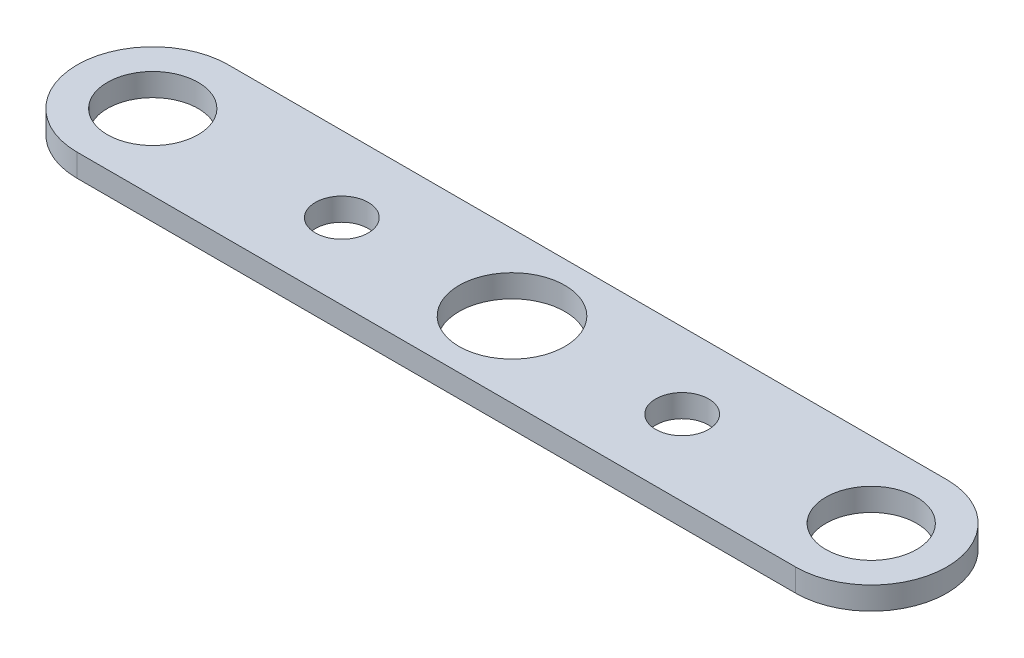
ISO-10303-21;
HEADER;
FILE_DESCRIPTION(('STEP AP214'),'2;1');
FILE_NAME('part.step','',(''),(''),'','','');
FILE_SCHEMA(('AUTOMOTIVE_DESIGN { 1 0 10303 214 1 1 1 1 }'));
ENDSEC;
DATA;
#1=APPLICATION_CONTEXT('core data for automotive mechanical design processes');
#2=APPLICATION_PROTOCOL_DEFINITION('international standard','automotive_design',2000,#1);
#3=PRODUCT_CONTEXT('',#1,'mechanical');
#4=PRODUCT('Part','Part','',(#3));
#5=PRODUCT_RELATED_PRODUCT_CATEGORY('part','',(#4));
#6=PRODUCT_DEFINITION_FORMATION('','',#4);
#7=PRODUCT_DEFINITION_CONTEXT('part definition',#1,'design');
#8=PRODUCT_DEFINITION('design','',#6,#7);
#9=PRODUCT_DEFINITION_SHAPE('','',#8);
#10=(LENGTH_UNIT() NAMED_UNIT(*) SI_UNIT(.MILLI.,.METRE.));
#11=(NAMED_UNIT(*) PLANE_ANGLE_UNIT() SI_UNIT($,.RADIAN.));
#12=(NAMED_UNIT(*) SI_UNIT($,.STERADIAN.) SOLID_ANGLE_UNIT());
#13=UNCERTAINTY_MEASURE_WITH_UNIT(LENGTH_MEASURE(1.E-05),#10,'distance_accuracy_value','');
#14=(GEOMETRIC_REPRESENTATION_CONTEXT(3) GLOBAL_UNCERTAINTY_ASSIGNED_CONTEXT((#13)) GLOBAL_UNIT_ASSIGNED_CONTEXT((#10,
#11,#12)) REPRESENTATION_CONTEXT('',''));
#15=CARTESIAN_POINT('',(0.,0.,0.));
#16=DIRECTION('',(0.,0.,1.));
#17=DIRECTION('',(1.,0.,0.));
#18=AXIS2_PLACEMENT_3D('',#15,#16,#17);
#19=CARTESIAN_POINT('',(-7.09255665925721,3.,-9.32692307692308));
#20=DIRECTION('',(0.,1.,0.));
#21=DIRECTION('',(0.,0.,1.));
#22=AXIS2_PLACEMENT_3D('',#19,#20,#21);
#23=PLANE('',#22);
#24=CARTESIAN_POINT('',(17.9074433407428,3.,-9.32692307692308));
#25=DIRECTION('',(0.,1.,0.));
#26=DIRECTION('',(0.,0.,1.));
#27=AXIS2_PLACEMENT_3D('',#24,#25,#26);
#28=CIRCLE('',#27,3.5);
#29=CARTESIAN_POINT('',(17.9074433407428,3.,-5.82692307692308));
#30=VERTEX_POINT('',#29);
#31=EDGE_CURVE('E161',#30,#30,#28,.T.);
#32=ORIENTED_EDGE('',*,*,#31,.F.);
#33=EDGE_LOOP('',(#32));
#34=FACE_BOUND('',#33,.T.);
#35=CARTESIAN_POINT('',(62.9074433407428,3.,-9.32692307692308));
#36=DIRECTION('',(0.,1.,0.));
#37=DIRECTION('',(0.,0.,1.));
#38=AXIS2_PLACEMENT_3D('',#35,#36,#37);
#39=CIRCLE('',#38,3.50000000000001);
#40=CARTESIAN_POINT('',(62.9074433407428,3.,-5.82692307692307));
#41=VERTEX_POINT('',#40);
#42=EDGE_CURVE('E153',#41,#41,#39,.T.);
#43=ORIENTED_EDGE('',*,*,#42,.F.);
#44=EDGE_LOOP('',(#43));
#45=FACE_BOUND('',#44,.T.);
#46=CARTESIAN_POINT('',(40.4074433407428,3.,-9.32692307692308));
#47=DIRECTION('',(0.,1.,0.));
#48=DIRECTION('',(0.,0.,1.));
#49=AXIS2_PLACEMENT_3D('',#46,#47,#48);
#50=CIRCLE('',#49,7.);
#51=CARTESIAN_POINT('',(40.4074433407428,3.,-2.32692307692308));
#52=VERTEX_POINT('',#51);
#53=EDGE_CURVE('E145',#52,#52,#50,.T.);
#54=ORIENTED_EDGE('',*,*,#53,.F.);
#55=EDGE_LOOP('',(#54));
#56=FACE_BOUND('',#55,.T.);
#57=CARTESIAN_POINT('',(-7.09255665925721,3.,-9.32692307692308));
#58=DIRECTION('',(0.,1.,0.));
#59=DIRECTION('',(0.,0.,1.));
#60=AXIS2_PLACEMENT_3D('',#57,#58,#59);
#61=CIRCLE('',#60,6.);
#62=CARTESIAN_POINT('',(-7.09255665925721,3.,-3.32692307692308));
#63=VERTEX_POINT('',#62);
#64=EDGE_CURVE('E111',#63,#63,#61,.T.);
#65=ORIENTED_EDGE('',*,*,#64,.F.);
#66=EDGE_LOOP('',(#65));
#67=FACE_BOUND('',#66,.T.);
#68=CARTESIAN_POINT('',(-7.09255665925721,3.,-9.32692307692308));
#69=DIRECTION('',(0.,1.,0.));
#70=DIRECTION('',(0.,0.,1.));
#71=AXIS2_PLACEMENT_3D('',#68,#69,#70);
#72=CIRCLE('',#71,10.);
#73=CARTESIAN_POINT('',(-7.09255665925721,3.,-19.3269230769231));
#74=VERTEX_POINT('',#73);
#75=CARTESIAN_POINT('',(-7.09255665925721,3.,0.673076923076923));
#76=VERTEX_POINT('',#75);
#77=EDGE_CURVE('E91',#74,#76,#72,.T.);
#78=ORIENTED_EDGE('',*,*,#77,.T.);
#79=DIRECTION('',(1.,0.,0.));
#80=VECTOR('',#79,1.);
#81=CARTESIAN_POINT('',(-7.09255665925721,3.,0.673076923076923));
#82=LINE('',#81,#80);
#83=CARTESIAN_POINT('',(87.9074433407428,3.,0.673076923076922));
#84=VERTEX_POINT('',#83);
#85=EDGE_CURVE('E86',#76,#84,#82,.T.);
#86=ORIENTED_EDGE('',*,*,#85,.T.);
#87=CARTESIAN_POINT('',(87.9074433407428,3.,-9.32692307692308));
#88=DIRECTION('',(0.,1.,0.));
#89=DIRECTION('',(0.,0.,1.));
#90=AXIS2_PLACEMENT_3D('',#87,#88,#89);
#91=CIRCLE('',#90,10.);
#92=CARTESIAN_POINT('',(87.9074433407428,3.,-19.3269230769231));
#93=VERTEX_POINT('',#92);
#94=EDGE_CURVE('E89',#84,#93,#91,.T.);
#95=ORIENTED_EDGE('',*,*,#94,.T.);
#96=DIRECTION('',(-1.,0.,0.));
#97=VECTOR('',#96,1.);
#98=CARTESIAN_POINT('',(-7.09255665925721,3.,-19.3269230769231));
#99=LINE('',#98,#97);
#100=EDGE_CURVE('E56',#93,#74,#99,.T.);
#101=ORIENTED_EDGE('',*,*,#100,.T.);
#102=EDGE_LOOP('',(#78,#86,#95,#101));
#103=FACE_BOUND('',#102,.T.);
#104=CARTESIAN_POINT('',(87.9074433407428,3.,-9.32692307692308));
#105=DIRECTION('',(0.,1.,0.));
#106=DIRECTION('',(0.,0.,1.));
#107=AXIS2_PLACEMENT_3D('',#104,#105,#106);
#108=CIRCLE('',#107,6.);
#109=CARTESIAN_POINT('',(87.9074433407428,3.,-3.32692307692308));
#110=VERTEX_POINT('',#109);
#111=EDGE_CURVE('E133',#110,#110,#108,.T.);
#112=ORIENTED_EDGE('',*,*,#111,.F.);
#113=EDGE_LOOP('',(#112));
#114=FACE_BOUND('',#113,.T.);
#115=ADVANCED_FACE('F38',(#34,#45,#56,#67,#103,#114),#23,.T.);
#116=CARTESIAN_POINT('',(-7.09255665925721,0.,-9.32692307692308));
#117=DIRECTION('',(0.,1.,0.));
#118=DIRECTION('',(0.,0.,1.));
#119=AXIS2_PLACEMENT_3D('',#116,#117,#118);
#120=PLANE('',#119);
#121=CARTESIAN_POINT('',(17.9074433407428,0.,-9.32692307692308));
#122=DIRECTION('',(0.,1.,0.));
#123=DIRECTION('',(0.,0.,1.));
#124=AXIS2_PLACEMENT_3D('',#121,#122,#123);
#125=CIRCLE('',#124,3.5);
#126=CARTESIAN_POINT('',(17.9074433407428,0.,-5.82692307692308));
#127=VERTEX_POINT('',#126);
#128=EDGE_CURVE('E149',#127,#127,#125,.T.);
#129=ORIENTED_EDGE('',*,*,#128,.T.);
#130=EDGE_LOOP('',(#129));
#131=FACE_BOUND('',#130,.T.);
#132=CARTESIAN_POINT('',(62.9074433407428,0.,-9.32692307692308));
#133=DIRECTION('',(0.,1.,0.));
#134=DIRECTION('',(0.,0.,1.));
#135=AXIS2_PLACEMENT_3D('',#132,#133,#134);
#136=CIRCLE('',#135,3.50000000000001);
#137=CARTESIAN_POINT('',(62.9074433407428,0.,-5.82692307692307));
#138=VERTEX_POINT('',#137);
#139=EDGE_CURVE('E157',#138,#138,#136,.T.);
#140=ORIENTED_EDGE('',*,*,#139,.T.);
#141=EDGE_LOOP('',(#140));
#142=FACE_BOUND('',#141,.T.);
#143=CARTESIAN_POINT('',(40.4074433407428,0.,-9.32692307692308));
#144=DIRECTION('',(0.,1.,0.));
#145=DIRECTION('',(0.,0.,1.));
#146=AXIS2_PLACEMENT_3D('',#143,#144,#145);
#147=CIRCLE('',#146,7.);
#148=CARTESIAN_POINT('',(40.4074433407428,0.,-2.32692307692308));
#149=VERTEX_POINT('',#148);
#150=EDGE_CURVE('E141',#149,#149,#147,.T.);
#151=ORIENTED_EDGE('',*,*,#150,.T.);
#152=EDGE_LOOP('',(#151));
#153=FACE_BOUND('',#152,.T.);
#154=CARTESIAN_POINT('',(-7.09255665925721,0.,-9.32692307692308));
#155=DIRECTION('',(0.,1.,0.));
#156=DIRECTION('',(0.,0.,1.));
#157=AXIS2_PLACEMENT_3D('',#154,#155,#156);
#158=CIRCLE('',#157,10.);
#159=CARTESIAN_POINT('',(-7.09255665925721,0.,-19.3269230769231));
#160=VERTEX_POINT('',#159);
#161=CARTESIAN_POINT('',(-7.09255665925721,0.,0.673076923076923));
#162=VERTEX_POINT('',#161);
#163=EDGE_CURVE('E107',#160,#162,#158,.T.);
#164=ORIENTED_EDGE('',*,*,#163,.F.);
#165=DIRECTION('',(-1.,0.,0.));
#166=VECTOR('',#165,1.);
#167=CARTESIAN_POINT('',(-7.09255665925721,0.,-19.3269230769231));
#168=LINE('',#167,#166);
#169=CARTESIAN_POINT('',(87.9074433407428,0.,-19.3269230769231));
#170=VERTEX_POINT('',#169);
#171=EDGE_CURVE('E79',#170,#160,#168,.T.);
#172=ORIENTED_EDGE('',*,*,#171,.F.);
#173=CARTESIAN_POINT('',(87.9074433407428,0.,-9.32692307692308));
#174=DIRECTION('',(0.,1.,0.));
#175=DIRECTION('',(0.,0.,1.));
#176=AXIS2_PLACEMENT_3D('',#173,#174,#175);
#177=CIRCLE('',#176,10.);
#178=CARTESIAN_POINT('',(87.9074433407428,0.,0.673076923076922));
#179=VERTEX_POINT('',#178);
#180=EDGE_CURVE('E73',#179,#170,#177,.T.);
#181=ORIENTED_EDGE('',*,*,#180,.F.);
#182=DIRECTION('',(1.,0.,0.));
#183=VECTOR('',#182,1.);
#184=CARTESIAN_POINT('',(-7.09255665925721,0.,0.673076923076923));
#185=LINE('',#184,#183);
#186=EDGE_CURVE('E96',#162,#179,#185,.T.);
#187=ORIENTED_EDGE('',*,*,#186,.F.);
#188=EDGE_LOOP('',(#164,#172,#181,#187));
#189=FACE_BOUND('',#188,.T.);
#190=CARTESIAN_POINT('',(-7.09255665925721,0.,-9.32692307692308));
#191=DIRECTION('',(0.,1.,0.));
#192=DIRECTION('',(0.,0.,1.));
#193=AXIS2_PLACEMENT_3D('',#190,#191,#192);
#194=CIRCLE('',#193,6.);
#195=CARTESIAN_POINT('',(-7.09255665925721,0.,-3.32692307692308));
#196=VERTEX_POINT('',#195);
#197=EDGE_CURVE('E129',#196,#196,#194,.T.);
#198=ORIENTED_EDGE('',*,*,#197,.T.);
#199=EDGE_LOOP('',(#198));
#200=FACE_BOUND('',#199,.T.);
#201=CARTESIAN_POINT('',(87.9074433407428,0.,-9.32692307692308));
#202=DIRECTION('',(0.,1.,0.));
#203=DIRECTION('',(0.,0.,1.));
#204=AXIS2_PLACEMENT_3D('',#201,#202,#203);
#205=CIRCLE('',#204,6.);
#206=CARTESIAN_POINT('',(87.9074433407428,0.,-3.32692307692308));
#207=VERTEX_POINT('',#206);
#208=EDGE_CURVE('E137',#207,#207,#205,.T.);
#209=ORIENTED_EDGE('',*,*,#208,.T.);
#210=EDGE_LOOP('',(#209));
#211=FACE_BOUND('',#210,.T.);
#212=ADVANCED_FACE('F124',(#131,#142,#153,#189,#200,#211),#120,.F.);
#213=CARTESIAN_POINT('',(-7.09255665925721,3.,-9.32692307692308));
#214=DIRECTION('',(0.,-1.,0.));
#215=DIRECTION('',(0.,0.,-1.));
#216=AXIS2_PLACEMENT_3D('',#213,#214,#215);
#217=CYLINDRICAL_SURFACE('',#216,10.);
#218=ORIENTED_EDGE('',*,*,#163,.T.);
#219=DIRECTION('',(0.,-1.,0.));
#220=VECTOR('',#219,1.);
#221=CARTESIAN_POINT('',(-7.09255665925721,3.,0.673076923076923));
#222=LINE('',#221,#220);
#223=EDGE_CURVE('E11',#76,#162,#222,.T.);
#224=ORIENTED_EDGE('',*,*,#223,.F.);
#225=ORIENTED_EDGE('',*,*,#77,.F.);
#226=DIRECTION('',(0.,-1.,0.));
#227=VECTOR('',#226,1.);
#228=CARTESIAN_POINT('',(-7.09255665925721,3.,-19.3269230769231));
#229=LINE('',#228,#227);
#230=EDGE_CURVE('E103',#74,#160,#229,.T.);
#231=ORIENTED_EDGE('',*,*,#230,.T.);
#232=EDGE_LOOP('',(#218,#224,#225,#231));
#233=FACE_BOUND('',#232,.T.);
#234=ADVANCED_FACE('F40',(#233),#217,.T.);
#235=CARTESIAN_POINT('',(-7.09255665925721,3.,0.673076923076923));
#236=DIRECTION('',(0.,0.,-1.));
#237=DIRECTION('',(-1.,0.,0.));
#238=AXIS2_PLACEMENT_3D('',#235,#236,#237);
#239=PLANE('',#238);
#240=ORIENTED_EDGE('',*,*,#186,.T.);
#241=DIRECTION('',(0.,-1.,0.));
#242=VECTOR('',#241,1.);
#243=CARTESIAN_POINT('',(87.9074433407428,3.,0.673076923076922));
#244=LINE('',#243,#242);
#245=EDGE_CURVE('E48',#84,#179,#244,.T.);
#246=ORIENTED_EDGE('',*,*,#245,.F.);
#247=ORIENTED_EDGE('',*,*,#85,.F.);
#248=ORIENTED_EDGE('',*,*,#223,.T.);
#249=EDGE_LOOP('',(#240,#246,#247,#248));
#250=FACE_BOUND('',#249,.T.);
#251=ADVANCED_FACE('F95',(#250),#239,.F.);
#252=CARTESIAN_POINT('',(87.9074433407428,3.,-9.32692307692308));
#253=DIRECTION('',(0.,-1.,0.));
#254=DIRECTION('',(0.,0.,-1.));
#255=AXIS2_PLACEMENT_3D('',#252,#253,#254);
#256=CYLINDRICAL_SURFACE('',#255,10.);
#257=ORIENTED_EDGE('',*,*,#180,.T.);
#258=DIRECTION('',(0.,-1.,0.));
#259=VECTOR('',#258,1.);
#260=CARTESIAN_POINT('',(87.9074433407428,3.,-19.3269230769231));
#261=LINE('',#260,#259);
#262=EDGE_CURVE('E98',#93,#170,#261,.T.);
#263=ORIENTED_EDGE('',*,*,#262,.F.);
#264=ORIENTED_EDGE('',*,*,#94,.F.);
#265=ORIENTED_EDGE('',*,*,#245,.T.);
#266=EDGE_LOOP('',(#257,#263,#264,#265));
#267=FACE_BOUND('',#266,.T.);
#268=ADVANCED_FACE('F99',(#267),#256,.T.);
#269=CARTESIAN_POINT('',(-7.09255665925721,3.,-19.3269230769231));
#270=DIRECTION('',(0.,0.,1.));
#271=DIRECTION('',(1.,0.,0.));
#272=AXIS2_PLACEMENT_3D('',#269,#270,#271);
#273=PLANE('',#272);
#274=ORIENTED_EDGE('',*,*,#171,.T.);
#275=ORIENTED_EDGE('',*,*,#230,.F.);
#276=ORIENTED_EDGE('',*,*,#100,.F.);
#277=ORIENTED_EDGE('',*,*,#262,.T.);
#278=EDGE_LOOP('',(#274,#275,#276,#277));
#279=FACE_BOUND('',#278,.T.);
#280=ADVANCED_FACE('F121',(#279),#273,.F.);
#281=CARTESIAN_POINT('',(-7.09255665925721,3.,-9.32692307692308));
#282=DIRECTION('',(0.,-1.,0.));
#283=DIRECTION('',(0.,0.,-1.));
#284=AXIS2_PLACEMENT_3D('',#281,#282,#283);
#285=CYLINDRICAL_SURFACE('',#284,6.);
#286=ORIENTED_EDGE('',*,*,#64,.T.);
#287=EDGE_LOOP('',(#286));
#288=FACE_BOUND('',#287,.T.);
#289=ORIENTED_EDGE('',*,*,#197,.F.);
#290=EDGE_LOOP('',(#289));
#291=FACE_BOUND('',#290,.T.);
#292=ADVANCED_FACE('F187',(#288,#291),#285,.F.);
#293=CARTESIAN_POINT('',(87.9074433407428,3.,-9.32692307692308));
#294=DIRECTION('',(0.,-1.,0.));
#295=DIRECTION('',(0.,0.,-1.));
#296=AXIS2_PLACEMENT_3D('',#293,#294,#295);
#297=CYLINDRICAL_SURFACE('',#296,6.);
#298=ORIENTED_EDGE('',*,*,#111,.T.);
#299=EDGE_LOOP('',(#298));
#300=FACE_BOUND('',#299,.T.);
#301=ORIENTED_EDGE('',*,*,#208,.F.);
#302=EDGE_LOOP('',(#301));
#303=FACE_BOUND('',#302,.T.);
#304=ADVANCED_FACE('F190',(#300,#303),#297,.F.);
#305=CARTESIAN_POINT('',(40.4074433407428,0.,-9.32692307692308));
#306=DIRECTION('',(0.,1.,0.));
#307=DIRECTION('',(0.,0.,1.));
#308=AXIS2_PLACEMENT_3D('',#305,#306,#307);
#309=CYLINDRICAL_SURFACE('',#308,7.);
#310=ORIENTED_EDGE('',*,*,#150,.F.);
#311=EDGE_LOOP('',(#310));
#312=FACE_BOUND('',#311,.T.);
#313=ORIENTED_EDGE('',*,*,#53,.T.);
#314=EDGE_LOOP('',(#313));
#315=FACE_BOUND('',#314,.T.);
#316=ADVANCED_FACE('F199',(#312,#315),#309,.F.);
#317=CARTESIAN_POINT('',(62.9074433407428,0.,-9.32692307692308));
#318=DIRECTION('',(0.,1.,0.));
#319=DIRECTION('',(0.,0.,1.));
#320=AXIS2_PLACEMENT_3D('',#317,#318,#319);
#321=CYLINDRICAL_SURFACE('',#320,3.50000000000001);
#322=ORIENTED_EDGE('',*,*,#139,.F.);
#323=EDGE_LOOP('',(#322));
#324=FACE_BOUND('',#323,.T.);
#325=ORIENTED_EDGE('',*,*,#42,.T.);
#326=EDGE_LOOP('',(#325));
#327=FACE_BOUND('',#326,.T.);
#328=ADVANCED_FACE('F174',(#324,#327),#321,.F.);
#329=CARTESIAN_POINT('',(17.9074433407428,0.,-9.32692307692308));
#330=DIRECTION('',(0.,1.,0.));
#331=DIRECTION('',(0.,0.,1.));
#332=AXIS2_PLACEMENT_3D('',#329,#330,#331);
#333=CYLINDRICAL_SURFACE('',#332,3.5);
#334=ORIENTED_EDGE('',*,*,#128,.F.);
#335=EDGE_LOOP('',(#334));
#336=FACE_BOUND('',#335,.T.);
#337=ORIENTED_EDGE('',*,*,#31,.T.);
#338=EDGE_LOOP('',(#337));
#339=FACE_BOUND('',#338,.T.);
#340=ADVANCED_FACE('F171',(#336,#339),#333,.F.);
#341=CLOSED_SHELL('',(#115,#212,#234,#251,#268,#280,#292,#304,#316,#328,#340));
#342=MANIFOLD_SOLID_BREP('B2',#341);
#343=ADVANCED_BREP_SHAPE_REPRESENTATION('',(#18,#342),#14);
#344=SHAPE_DEFINITION_REPRESENTATION(#9,#343);
ENDSEC;
END-ISO-10303-21;
